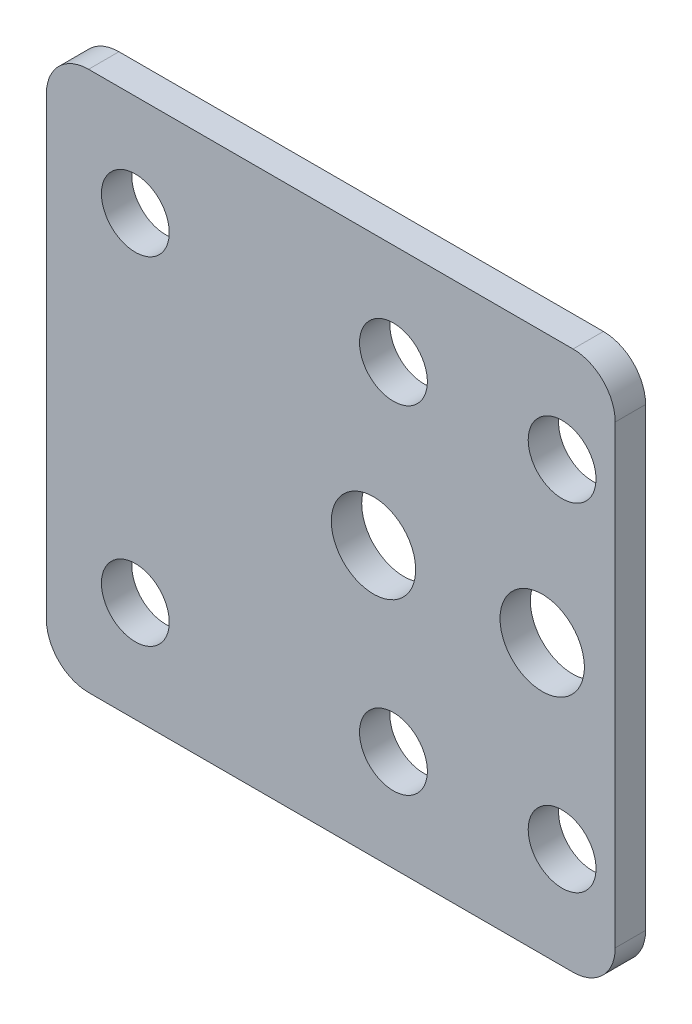
ISO-10303-21;
HEADER;
FILE_DESCRIPTION(('STEP AP214'),'2;1');
FILE_NAME('part.step','',(''),(''),'','','');
FILE_SCHEMA(('AUTOMOTIVE_DESIGN { 1 0 10303 214 1 1 1 1 }'));
ENDSEC;
DATA;
#1=APPLICATION_CONTEXT('core data for automotive mechanical design processes');
#2=APPLICATION_PROTOCOL_DEFINITION('international standard','automotive_design',2000,#1);
#3=PRODUCT_CONTEXT('',#1,'mechanical');
#4=PRODUCT('Part','Part','',(#3));
#5=PRODUCT_RELATED_PRODUCT_CATEGORY('part','',(#4));
#6=PRODUCT_DEFINITION_FORMATION('','',#4);
#7=PRODUCT_DEFINITION_CONTEXT('part definition',#1,'design');
#8=PRODUCT_DEFINITION('design','',#6,#7);
#9=PRODUCT_DEFINITION_SHAPE('','',#8);
#10=(LENGTH_UNIT() NAMED_UNIT(*) SI_UNIT(.MILLI.,.METRE.));
#11=(NAMED_UNIT(*) PLANE_ANGLE_UNIT() SI_UNIT($,.RADIAN.));
#12=(NAMED_UNIT(*) SI_UNIT($,.STERADIAN.) SOLID_ANGLE_UNIT());
#13=UNCERTAINTY_MEASURE_WITH_UNIT(LENGTH_MEASURE(1.E-05),#10,'distance_accuracy_value','');
#14=(GEOMETRIC_REPRESENTATION_CONTEXT(3) GLOBAL_UNCERTAINTY_ASSIGNED_CONTEXT((#13)) GLOBAL_UNIT_ASSIGNED_CONTEXT((#10,
#11,#12)) REPRESENTATION_CONTEXT('',''));
#15=CARTESIAN_POINT('',(0.,0.,0.));
#16=DIRECTION('',(0.,0.,1.));
#17=DIRECTION('',(1.,0.,0.));
#18=AXIS2_PLACEMENT_3D('',#15,#16,#17);
#19=CARTESIAN_POINT('',(-157.318460543692,-191.501541921578,2.286));
#20=DIRECTION('',(1.,0.,0.));
#21=DIRECTION('',(0.,0.,-1.));
#22=AXIS2_PLACEMENT_3D('',#19,#20,#21);
#23=PLANE('',#22);
#24=DIRECTION('',(0.,-1.,0.));
#25=VECTOR('',#24,1.);
#26=CARTESIAN_POINT('',(-157.318460543692,-191.501541921578,2.286));
#27=LINE('',#26,#25);
#28=CARTESIAN_POINT('',(-157.318460543692,-154.036541921578,2.286));
#29=VERTEX_POINT('',#28);
#30=CARTESIAN_POINT('',(-157.318460543692,-188.326541921578,2.286));
#31=VERTEX_POINT('',#30);
#32=EDGE_CURVE('E124',#29,#31,#27,.T.);
#33=ORIENTED_EDGE('',*,*,#32,.F.);
#34=DIRECTION('',(0.,0.,-1.));
#35=VECTOR('',#34,1.);
#36=CARTESIAN_POINT('',(-157.318460543692,-154.036541921578,2.286));
#37=LINE('',#36,#35);
#38=CARTESIAN_POINT('',(-157.318460543692,-154.036541921578,0.));
#39=VERTEX_POINT('',#38);
#40=EDGE_CURVE('E110',#29,#39,#37,.T.);
#41=ORIENTED_EDGE('',*,*,#40,.T.);
#42=DIRECTION('',(0.,-1.,0.));
#43=VECTOR('',#42,1.);
#44=CARTESIAN_POINT('',(-157.318460543692,-191.501541921578,0.));
#45=LINE('',#44,#43);
#46=CARTESIAN_POINT('',(-157.318460543692,-188.326541921578,0.));
#47=VERTEX_POINT('',#46);
#48=EDGE_CURVE('E121',#39,#47,#45,.T.);
#49=ORIENTED_EDGE('',*,*,#48,.T.);
#50=DIRECTION('',(0.,0.,-1.));
#51=VECTOR('',#50,1.);
#52=CARTESIAN_POINT('',(-157.318460543692,-188.326541921578,2.286));
#53=LINE('',#52,#51);
#54=EDGE_CURVE('E125',#47,#31,#53,.F.);
#55=ORIENTED_EDGE('',*,*,#54,.T.);
#56=EDGE_LOOP('',(#33,#41,#49,#55));
#57=FACE_BOUND('',#56,.T.);
#58=ADVANCED_FACE('F38',(#57),#23,.F.);
#59=CARTESIAN_POINT('',(-157.318460543692,-191.501541921578,2.286));
#60=DIRECTION('',(0.,1.,0.));
#61=DIRECTION('',(-1.,0.,0.));
#62=AXIS2_PLACEMENT_3D('',#59,#60,#61);
#63=PLANE('',#62);
#64=DIRECTION('',(1.,0.,0.));
#65=VECTOR('',#64,1.);
#66=CARTESIAN_POINT('',(-157.318460543692,-191.501541921578,0.));
#67=LINE('',#66,#65);
#68=CARTESIAN_POINT('',(-154.143460543692,-191.501541921578,0.));
#69=VERTEX_POINT('',#68);
#70=CARTESIAN_POINT('',(-117.667699999999,-191.501541921578,0.));
#71=VERTEX_POINT('',#70);
#72=EDGE_CURVE('E130',#69,#71,#67,.T.);
#73=ORIENTED_EDGE('',*,*,#72,.T.);
#74=DIRECTION('',(0.,0.,1.));
#75=VECTOR('',#74,1.);
#76=CARTESIAN_POINT('',(-117.667699999999,-191.501541921578,2.286));
#77=LINE('',#76,#75);
#78=CARTESIAN_POINT('',(-117.667699999999,-191.501541921578,2.286));
#79=VERTEX_POINT('',#78);
#80=EDGE_CURVE('E154',#71,#79,#77,.T.);
#81=ORIENTED_EDGE('',*,*,#80,.T.);
#82=DIRECTION('',(1.,0.,0.));
#83=VECTOR('',#82,1.);
#84=CARTESIAN_POINT('',(-157.318460543692,-191.501541921578,2.286));
#85=LINE('',#84,#83);
#86=CARTESIAN_POINT('',(-154.143460543692,-191.501541921578,2.286));
#87=VERTEX_POINT('',#86);
#88=EDGE_CURVE('E179',#87,#79,#85,.T.);
#89=ORIENTED_EDGE('',*,*,#88,.F.);
#90=DIRECTION('',(0.,0.,-1.));
#91=VECTOR('',#90,1.);
#92=CARTESIAN_POINT('',(-154.143460543692,-191.501541921578,2.286));
#93=LINE('',#92,#91);
#94=EDGE_CURVE('E151',#87,#69,#93,.T.);
#95=ORIENTED_EDGE('',*,*,#94,.T.);
#96=EDGE_LOOP('',(#73,#81,#89,#95));
#97=FACE_BOUND('',#96,.T.);
#98=ADVANCED_FACE('F169',(#97),#63,.F.);
#99=CARTESIAN_POINT('',(-157.318460543692,-150.861541921578,2.286));
#100=DIRECTION('',(0.,-1.,0.));
#101=DIRECTION('',(0.,0.,-1.));
#102=AXIS2_PLACEMENT_3D('',#99,#100,#101);
#103=PLANE('',#102);
#104=DIRECTION('',(-1.,0.,0.));
#105=VECTOR('',#104,1.);
#106=CARTESIAN_POINT('',(-157.318460543692,-150.861541921578,2.286));
#107=LINE('',#106,#105);
#108=CARTESIAN_POINT('',(-117.667699999999,-150.861541921578,2.286));
#109=VERTEX_POINT('',#108);
#110=CARTESIAN_POINT('',(-154.143460543692,-150.861541921578,2.286));
#111=VERTEX_POINT('',#110);
#112=EDGE_CURVE('E140',#109,#111,#107,.T.);
#113=ORIENTED_EDGE('',*,*,#112,.F.);
#114=DIRECTION('',(0.,0.,-1.));
#115=VECTOR('',#114,1.);
#116=CARTESIAN_POINT('',(-117.667699999999,-150.861541921578,2.286));
#117=LINE('',#116,#115);
#118=CARTESIAN_POINT('',(-117.667699999999,-150.861541921578,0.));
#119=VERTEX_POINT('',#118);
#120=EDGE_CURVE('E11',#109,#119,#117,.T.);
#121=ORIENTED_EDGE('',*,*,#120,.T.);
#122=DIRECTION('',(-1.,0.,0.));
#123=VECTOR('',#122,1.);
#124=CARTESIAN_POINT('',(-157.318460543692,-150.861541921578,0.));
#125=LINE('',#124,#123);
#126=CARTESIAN_POINT('',(-154.143460543692,-150.861541921578,0.));
#127=VERTEX_POINT('',#126);
#128=EDGE_CURVE('E134',#119,#127,#125,.T.);
#129=ORIENTED_EDGE('',*,*,#128,.T.);
#130=DIRECTION('',(0.,0.,-1.));
#131=VECTOR('',#130,1.);
#132=CARTESIAN_POINT('',(-154.143460543692,-150.861541921578,2.286));
#133=LINE('',#132,#131);
#134=EDGE_CURVE('E112',#127,#111,#133,.F.);
#135=ORIENTED_EDGE('',*,*,#134,.T.);
#136=EDGE_LOOP('',(#113,#121,#129,#135));
#137=FACE_BOUND('',#136,.T.);
#138=ADVANCED_FACE('F230',(#137),#103,.F.);
#139=CARTESIAN_POINT('',(0.,0.,2.286));
#140=DIRECTION('',(0.,0.,-1.));
#141=DIRECTION('',(-1.,0.,0.));
#142=AXIS2_PLACEMENT_3D('',#139,#140,#141);
#143=PLANE('',#142);
#144=CARTESIAN_POINT('',(-131.191799999999,-183.881541921578,2.286));
#145=DIRECTION('',(0.,0.,-1.));
#146=DIRECTION('',(-1.,0.,0.));
#147=AXIS2_PLACEMENT_3D('',#144,#145,#146);
#148=CIRCLE('',#147,2.55270000000001);
#149=CARTESIAN_POINT('',(-133.744499999999,-183.881541921578,2.286));
#150=VERTEX_POINT('',#149);
#151=EDGE_CURVE('E187',#150,#150,#148,.F.);
#152=ORIENTED_EDGE('',*,*,#151,.F.);
#153=EDGE_LOOP('',(#152));
#154=FACE_BOUND('',#153,.T.);
#155=CARTESIAN_POINT('',(-132.691799999999,-171.181541921578,2.286));
#156=DIRECTION('',(0.,0.,-1.));
#157=DIRECTION('',(-1.,0.,0.));
#158=AXIS2_PLACEMENT_3D('',#155,#156,#157);
#159=CIRCLE('',#158,3.175);
#160=CARTESIAN_POINT('',(-135.866799999999,-171.181541921578,2.286));
#161=VERTEX_POINT('',#160);
#162=EDGE_CURVE('E193',#161,#161,#159,.F.);
#163=ORIENTED_EDGE('',*,*,#162,.F.);
#164=EDGE_LOOP('',(#163));
#165=FACE_BOUND('',#164,.T.);
#166=CARTESIAN_POINT('',(-131.191799999999,-158.481541921578,2.286));
#167=DIRECTION('',(0.,0.,-1.));
#168=DIRECTION('',(-1.,0.,0.));
#169=AXIS2_PLACEMENT_3D('',#166,#167,#168);
#170=CIRCLE('',#169,2.55270000000001);
#171=CARTESIAN_POINT('',(-133.744499999999,-158.481541921578,2.286));
#172=VERTEX_POINT('',#171);
#173=EDGE_CURVE('E199',#172,#172,#170,.F.);
#174=ORIENTED_EDGE('',*,*,#173,.F.);
#175=EDGE_LOOP('',(#174));
#176=FACE_BOUND('',#175,.T.);
#177=CARTESIAN_POINT('',(-118.491799999999,-183.881541921578,2.286));
#178=DIRECTION('',(0.,0.,-1.));
#179=DIRECTION('',(-1.,0.,0.));
#180=AXIS2_PLACEMENT_3D('',#177,#178,#179);
#181=CIRCLE('',#180,2.55270000000001);
#182=CARTESIAN_POINT('',(-121.044499999999,-183.881541921578,2.286));
#183=VERTEX_POINT('',#182);
#184=EDGE_CURVE('E205',#183,#183,#181,.F.);
#185=ORIENTED_EDGE('',*,*,#184,.F.);
#186=EDGE_LOOP('',(#185));
#187=FACE_BOUND('',#186,.T.);
#188=CARTESIAN_POINT('',(-119.991799999999,-171.181541921578,2.286));
#189=DIRECTION('',(0.,0.,-1.));
#190=DIRECTION('',(-1.,0.,0.));
#191=AXIS2_PLACEMENT_3D('',#188,#189,#190);
#192=CIRCLE('',#191,3.175);
#193=CARTESIAN_POINT('',(-123.166799999999,-171.181541921578,2.286));
#194=VERTEX_POINT('',#193);
#195=EDGE_CURVE('E211',#194,#194,#192,.F.);
#196=ORIENTED_EDGE('',*,*,#195,.F.);
#197=EDGE_LOOP('',(#196));
#198=FACE_BOUND('',#197,.T.);
#199=CARTESIAN_POINT('',(-118.491799999999,-158.481541921578,2.286));
#200=DIRECTION('',(0.,0.,-1.));
#201=DIRECTION('',(-1.,0.,0.));
#202=AXIS2_PLACEMENT_3D('',#199,#200,#201);
#203=CIRCLE('',#202,2.55270000000001);
#204=CARTESIAN_POINT('',(-121.044499999999,-158.481541921578,2.286));
#205=VERTEX_POINT('',#204);
#206=EDGE_CURVE('E217',#205,#205,#203,.F.);
#207=ORIENTED_EDGE('',*,*,#206,.F.);
#208=EDGE_LOOP('',(#207));
#209=FACE_BOUND('',#208,.T.);
#210=CARTESIAN_POINT('',(-150.623199999999,-183.881541921578,2.286));
#211=DIRECTION('',(0.,0.,-1.));
#212=DIRECTION('',(-1.,0.,0.));
#213=AXIS2_PLACEMENT_3D('',#210,#211,#212);
#214=CIRCLE('',#213,2.55270000000001);
#215=CARTESIAN_POINT('',(-153.175899999999,-183.881541921578,2.286));
#216=VERTEX_POINT('',#215);
#217=EDGE_CURVE('E223',#216,#216,#214,.F.);
#218=ORIENTED_EDGE('',*,*,#217,.F.);
#219=EDGE_LOOP('',(#218));
#220=FACE_BOUND('',#219,.T.);
#221=CARTESIAN_POINT('',(-150.623199999999,-158.481541921578,2.286));
#222=DIRECTION('',(0.,0.,-1.));
#223=DIRECTION('',(-1.,0.,0.));
#224=AXIS2_PLACEMENT_3D('',#221,#222,#223);
#225=CIRCLE('',#224,2.55269999999999);
#226=CARTESIAN_POINT('',(-153.175899999999,-158.481541921578,2.286));
#227=VERTEX_POINT('',#226);
#228=EDGE_CURVE('E131',#227,#227,#225,.F.);
#229=ORIENTED_EDGE('',*,*,#228,.F.);
#230=EDGE_LOOP('',(#229));
#231=FACE_BOUND('',#230,.T.);
#232=ORIENTED_EDGE('',*,*,#88,.T.);
#233=CARTESIAN_POINT('',(-117.667699999999,-188.326541921578,2.286));
#234=DIRECTION('',(0.,0.,-1.));
#235=DIRECTION('',(-1.,0.,0.));
#236=AXIS2_PLACEMENT_3D('',#233,#234,#235);
#237=CIRCLE('',#236,3.175);
#238=CARTESIAN_POINT('',(-114.492699999999,-188.326541921578,2.286));
#239=VERTEX_POINT('',#238);
#240=EDGE_CURVE('E159',#79,#239,#237,.F.);
#241=ORIENTED_EDGE('',*,*,#240,.T.);
#242=DIRECTION('',(0.,-1.,0.));
#243=VECTOR('',#242,1.);
#244=CARTESIAN_POINT('',(-114.492699999999,-202.564565206785,2.286));
#245=LINE('',#244,#243);
#246=CARTESIAN_POINT('',(-114.492699999999,-154.036541921578,2.286));
#247=VERTEX_POINT('',#246);
#248=EDGE_CURVE('E177',#247,#239,#245,.T.);
#249=ORIENTED_EDGE('',*,*,#248,.F.);
#250=CARTESIAN_POINT('',(-117.667699999999,-154.036541921578,2.286));
#251=DIRECTION('',(0.,0.,-1.));
#252=DIRECTION('',(-1.,0.,0.));
#253=AXIS2_PLACEMENT_3D('',#250,#251,#252);
#254=CIRCLE('',#253,3.175);
#255=EDGE_CURVE('E157',#247,#109,#254,.F.);
#256=ORIENTED_EDGE('',*,*,#255,.T.);
#257=ORIENTED_EDGE('',*,*,#112,.T.);
#258=CARTESIAN_POINT('',(-154.143460543692,-154.036541921578,2.286));
#259=DIRECTION('',(0.,0.,-1.));
#260=DIRECTION('',(-1.,0.,0.));
#261=AXIS2_PLACEMENT_3D('',#258,#259,#260);
#262=CIRCLE('',#261,3.175);
#263=EDGE_CURVE('E149',#111,#29,#262,.F.);
#264=ORIENTED_EDGE('',*,*,#263,.T.);
#265=ORIENTED_EDGE('',*,*,#32,.T.);
#266=CARTESIAN_POINT('',(-154.143460543692,-188.326541921578,2.286));
#267=DIRECTION('',(0.,0.,-1.));
#268=DIRECTION('',(-1.,0.,0.));
#269=AXIS2_PLACEMENT_3D('',#266,#267,#268);
#270=CIRCLE('',#269,3.175);
#271=EDGE_CURVE('E147',#31,#87,#270,.F.);
#272=ORIENTED_EDGE('',*,*,#271,.T.);
#273=EDGE_LOOP('',(#232,#241,#249,#256,#257,#264,#265,#272));
#274=FACE_BOUND('',#273,.T.);
#275=ADVANCED_FACE('F176',(#154,#165,#176,#187,#198,#209,#220,#231,#274),#143,.F.);
#276=CARTESIAN_POINT('',(0.,0.,0.));
#277=DIRECTION('',(0.,0.,-1.));
#278=DIRECTION('',(-1.,0.,0.));
#279=AXIS2_PLACEMENT_3D('',#276,#277,#278);
#280=PLANE('',#279);
#281=DIRECTION('',(0.,-1.,0.));
#282=VECTOR('',#281,1.);
#283=CARTESIAN_POINT('',(-114.492699999999,-202.564565206785,0.));
#284=LINE('',#283,#282);
#285=CARTESIAN_POINT('',(-114.492699999999,-154.036541921578,0.));
#286=VERTEX_POINT('',#285);
#287=CARTESIAN_POINT('',(-114.492699999999,-188.326541921578,0.));
#288=VERTEX_POINT('',#287);
#289=EDGE_CURVE('E165',#286,#288,#284,.T.);
#290=ORIENTED_EDGE('',*,*,#289,.T.);
#291=CARTESIAN_POINT('',(-117.667699999999,-188.326541921578,0.));
#292=DIRECTION('',(0.,0.,-1.));
#293=DIRECTION('',(-1.,0.,0.));
#294=AXIS2_PLACEMENT_3D('',#291,#292,#293);
#295=CIRCLE('',#294,3.175);
#296=EDGE_CURVE('E46',#288,#71,#295,.T.);
#297=ORIENTED_EDGE('',*,*,#296,.T.);
#298=ORIENTED_EDGE('',*,*,#72,.F.);
#299=CARTESIAN_POINT('',(-154.143460543692,-188.326541921578,0.));
#300=DIRECTION('',(0.,0.,-1.));
#301=DIRECTION('',(-1.,0.,0.));
#302=AXIS2_PLACEMENT_3D('',#299,#300,#301);
#303=CIRCLE('',#302,3.175);
#304=EDGE_CURVE('E116',#69,#47,#303,.T.);
#305=ORIENTED_EDGE('',*,*,#304,.T.);
#306=ORIENTED_EDGE('',*,*,#48,.F.);
#307=CARTESIAN_POINT('',(-154.143460543692,-154.036541921578,0.));
#308=DIRECTION('',(0.,0.,-1.));
#309=DIRECTION('',(-1.,0.,0.));
#310=AXIS2_PLACEMENT_3D('',#307,#308,#309);
#311=CIRCLE('',#310,3.175);
#312=EDGE_CURVE('E106',#39,#127,#311,.T.);
#313=ORIENTED_EDGE('',*,*,#312,.T.);
#314=ORIENTED_EDGE('',*,*,#128,.F.);
#315=CARTESIAN_POINT('',(-117.667699999999,-154.036541921578,0.));
#316=DIRECTION('',(0.,0.,-1.));
#317=DIRECTION('',(-1.,0.,0.));
#318=AXIS2_PLACEMENT_3D('',#315,#316,#317);
#319=CIRCLE('',#318,3.175);
#320=EDGE_CURVE('E53',#119,#286,#319,.T.);
#321=ORIENTED_EDGE('',*,*,#320,.T.);
#322=EDGE_LOOP('',(#290,#297,#298,#305,#306,#313,#314,#321));
#323=FACE_BOUND('',#322,.T.);
#324=CARTESIAN_POINT('',(-131.191799999999,-183.881541921578,0.));
#325=DIRECTION('',(0.,0.,-1.));
#326=DIRECTION('',(-1.,0.,0.));
#327=AXIS2_PLACEMENT_3D('',#324,#325,#326);
#328=CIRCLE('',#327,2.55270000000001);
#329=CARTESIAN_POINT('',(-133.744499999999,-183.881541921578,0.));
#330=VERTEX_POINT('',#329);
#331=EDGE_CURVE('E182',#330,#330,#328,.T.);
#332=ORIENTED_EDGE('',*,*,#331,.F.);
#333=EDGE_LOOP('',(#332));
#334=FACE_BOUND('',#333,.T.);
#335=CARTESIAN_POINT('',(-132.691799999999,-171.181541921578,0.));
#336=DIRECTION('',(0.,0.,-1.));
#337=DIRECTION('',(-1.,0.,0.));
#338=AXIS2_PLACEMENT_3D('',#335,#336,#337);
#339=CIRCLE('',#338,3.175);
#340=CARTESIAN_POINT('',(-135.866799999999,-171.181541921578,0.));
#341=VERTEX_POINT('',#340);
#342=EDGE_CURVE('E190',#341,#341,#339,.T.);
#343=ORIENTED_EDGE('',*,*,#342,.F.);
#344=EDGE_LOOP('',(#343));
#345=FACE_BOUND('',#344,.T.);
#346=CARTESIAN_POINT('',(-131.191799999999,-158.481541921578,0.));
#347=DIRECTION('',(0.,0.,-1.));
#348=DIRECTION('',(-1.,0.,0.));
#349=AXIS2_PLACEMENT_3D('',#346,#347,#348);
#350=CIRCLE('',#349,2.55270000000001);
#351=CARTESIAN_POINT('',(-133.744499999999,-158.481541921578,0.));
#352=VERTEX_POINT('',#351);
#353=EDGE_CURVE('E196',#352,#352,#350,.T.);
#354=ORIENTED_EDGE('',*,*,#353,.F.);
#355=EDGE_LOOP('',(#354));
#356=FACE_BOUND('',#355,.T.);
#357=CARTESIAN_POINT('',(-118.491799999999,-183.881541921578,0.));
#358=DIRECTION('',(0.,0.,-1.));
#359=DIRECTION('',(-1.,0.,0.));
#360=AXIS2_PLACEMENT_3D('',#357,#358,#359);
#361=CIRCLE('',#360,2.55270000000001);
#362=CARTESIAN_POINT('',(-121.044499999999,-183.881541921578,0.));
#363=VERTEX_POINT('',#362);
#364=EDGE_CURVE('E202',#363,#363,#361,.T.);
#365=ORIENTED_EDGE('',*,*,#364,.F.);
#366=EDGE_LOOP('',(#365));
#367=FACE_BOUND('',#366,.T.);
#368=CARTESIAN_POINT('',(-119.991799999999,-171.181541921578,0.));
#369=DIRECTION('',(0.,0.,-1.));
#370=DIRECTION('',(-1.,0.,0.));
#371=AXIS2_PLACEMENT_3D('',#368,#369,#370);
#372=CIRCLE('',#371,3.175);
#373=CARTESIAN_POINT('',(-123.166799999999,-171.181541921578,0.));
#374=VERTEX_POINT('',#373);
#375=EDGE_CURVE('E208',#374,#374,#372,.T.);
#376=ORIENTED_EDGE('',*,*,#375,.F.);
#377=EDGE_LOOP('',(#376));
#378=FACE_BOUND('',#377,.T.);
#379=CARTESIAN_POINT('',(-118.491799999999,-158.481541921578,0.));
#380=DIRECTION('',(0.,0.,-1.));
#381=DIRECTION('',(-1.,0.,0.));
#382=AXIS2_PLACEMENT_3D('',#379,#380,#381);
#383=CIRCLE('',#382,2.55270000000001);
#384=CARTESIAN_POINT('',(-121.044499999999,-158.481541921578,0.));
#385=VERTEX_POINT('',#384);
#386=EDGE_CURVE('E214',#385,#385,#383,.T.);
#387=ORIENTED_EDGE('',*,*,#386,.F.);
#388=EDGE_LOOP('',(#387));
#389=FACE_BOUND('',#388,.T.);
#390=CARTESIAN_POINT('',(-150.623199999999,-183.881541921578,0.));
#391=DIRECTION('',(0.,0.,-1.));
#392=DIRECTION('',(-1.,0.,0.));
#393=AXIS2_PLACEMENT_3D('',#390,#391,#392);
#394=CIRCLE('',#393,2.55270000000001);
#395=CARTESIAN_POINT('',(-153.175899999999,-183.881541921578,0.));
#396=VERTEX_POINT('',#395);
#397=EDGE_CURVE('E220',#396,#396,#394,.T.);
#398=ORIENTED_EDGE('',*,*,#397,.F.);
#399=EDGE_LOOP('',(#398));
#400=FACE_BOUND('',#399,.T.);
#401=CARTESIAN_POINT('',(-150.623199999999,-158.481541921578,0.));
#402=DIRECTION('',(0.,0.,-1.));
#403=DIRECTION('',(-1.,0.,0.));
#404=AXIS2_PLACEMENT_3D('',#401,#402,#403);
#405=CIRCLE('',#404,2.55269999999999);
#406=CARTESIAN_POINT('',(-153.175899999999,-158.481541921578,0.));
#407=VERTEX_POINT('',#406);
#408=EDGE_CURVE('E137',#407,#407,#405,.T.);
#409=ORIENTED_EDGE('',*,*,#408,.F.);
#410=EDGE_LOOP('',(#409));
#411=FACE_BOUND('',#410,.T.);
#412=ADVANCED_FACE('F127',(#323,#334,#345,#356,#367,#378,#389,#400,#411),#280,.T.);
#413=CARTESIAN_POINT('',(-150.623199999999,-158.481541921578,2.287));
#414=DIRECTION('',(0.,0.,-1.));
#415=DIRECTION('',(-1.,0.,0.));
#416=AXIS2_PLACEMENT_3D('',#413,#414,#415);
#417=CYLINDRICAL_SURFACE('',#416,2.55269999999999);
#418=ORIENTED_EDGE('',*,*,#408,.T.);
#419=EDGE_LOOP('',(#418));
#420=FACE_BOUND('',#419,.T.);
#421=ORIENTED_EDGE('',*,*,#228,.T.);
#422=EDGE_LOOP('',(#421));
#423=FACE_BOUND('',#422,.T.);
#424=ADVANCED_FACE('F283',(#420,#423),#417,.F.);
#425=CARTESIAN_POINT('',(-150.623199999999,-183.881541921578,2.287));
#426=DIRECTION('',(0.,0.,-1.));
#427=DIRECTION('',(-1.,0.,0.));
#428=AXIS2_PLACEMENT_3D('',#425,#426,#427);
#429=CYLINDRICAL_SURFACE('',#428,2.55270000000001);
#430=ORIENTED_EDGE('',*,*,#397,.T.);
#431=EDGE_LOOP('',(#430));
#432=FACE_BOUND('',#431,.T.);
#433=ORIENTED_EDGE('',*,*,#217,.T.);
#434=EDGE_LOOP('',(#433));
#435=FACE_BOUND('',#434,.T.);
#436=ADVANCED_FACE('F279',(#432,#435),#429,.F.);
#437=CARTESIAN_POINT('',(-118.491799999999,-158.481541921578,2.287));
#438=DIRECTION('',(0.,0.,-1.));
#439=DIRECTION('',(-1.,0.,0.));
#440=AXIS2_PLACEMENT_3D('',#437,#438,#439);
#441=CYLINDRICAL_SURFACE('',#440,2.55270000000001);
#442=ORIENTED_EDGE('',*,*,#386,.T.);
#443=EDGE_LOOP('',(#442));
#444=FACE_BOUND('',#443,.T.);
#445=ORIENTED_EDGE('',*,*,#206,.T.);
#446=EDGE_LOOP('',(#445));
#447=FACE_BOUND('',#446,.T.);
#448=ADVANCED_FACE('F275',(#444,#447),#441,.F.);
#449=CARTESIAN_POINT('',(-119.991799999999,-171.181541921578,2.287));
#450=DIRECTION('',(0.,0.,-1.));
#451=DIRECTION('',(-1.,0.,0.));
#452=AXIS2_PLACEMENT_3D('',#449,#450,#451);
#453=CYLINDRICAL_SURFACE('',#452,3.175);
#454=ORIENTED_EDGE('',*,*,#375,.T.);
#455=EDGE_LOOP('',(#454));
#456=FACE_BOUND('',#455,.T.);
#457=ORIENTED_EDGE('',*,*,#195,.T.);
#458=EDGE_LOOP('',(#457));
#459=FACE_BOUND('',#458,.T.);
#460=ADVANCED_FACE('F271',(#456,#459),#453,.F.);
#461=CARTESIAN_POINT('',(-118.491799999999,-183.881541921578,2.287));
#462=DIRECTION('',(0.,0.,-1.));
#463=DIRECTION('',(-1.,0.,0.));
#464=AXIS2_PLACEMENT_3D('',#461,#462,#463);
#465=CYLINDRICAL_SURFACE('',#464,2.55270000000001);
#466=ORIENTED_EDGE('',*,*,#364,.T.);
#467=EDGE_LOOP('',(#466));
#468=FACE_BOUND('',#467,.T.);
#469=ORIENTED_EDGE('',*,*,#184,.T.);
#470=EDGE_LOOP('',(#469));
#471=FACE_BOUND('',#470,.T.);
#472=ADVANCED_FACE('F267',(#468,#471),#465,.F.);
#473=CARTESIAN_POINT('',(-131.191799999999,-158.481541921578,2.287));
#474=DIRECTION('',(0.,0.,-1.));
#475=DIRECTION('',(-1.,0.,0.));
#476=AXIS2_PLACEMENT_3D('',#473,#474,#475);
#477=CYLINDRICAL_SURFACE('',#476,2.55270000000001);
#478=ORIENTED_EDGE('',*,*,#353,.T.);
#479=EDGE_LOOP('',(#478));
#480=FACE_BOUND('',#479,.T.);
#481=ORIENTED_EDGE('',*,*,#173,.T.);
#482=EDGE_LOOP('',(#481));
#483=FACE_BOUND('',#482,.T.);
#484=ADVANCED_FACE('F263',(#480,#483),#477,.F.);
#485=CARTESIAN_POINT('',(-132.691799999999,-171.181541921578,2.287));
#486=DIRECTION('',(0.,0.,-1.));
#487=DIRECTION('',(-1.,0.,0.));
#488=AXIS2_PLACEMENT_3D('',#485,#486,#487);
#489=CYLINDRICAL_SURFACE('',#488,3.175);
#490=ORIENTED_EDGE('',*,*,#342,.T.);
#491=EDGE_LOOP('',(#490));
#492=FACE_BOUND('',#491,.T.);
#493=ORIENTED_EDGE('',*,*,#162,.T.);
#494=EDGE_LOOP('',(#493));
#495=FACE_BOUND('',#494,.T.);
#496=ADVANCED_FACE('F259',(#492,#495),#489,.F.);
#497=CARTESIAN_POINT('',(-131.191799999999,-183.881541921578,2.287));
#498=DIRECTION('',(0.,0.,-1.));
#499=DIRECTION('',(-1.,0.,0.));
#500=AXIS2_PLACEMENT_3D('',#497,#498,#499);
#501=CYLINDRICAL_SURFACE('',#500,2.55270000000001);
#502=ORIENTED_EDGE('',*,*,#331,.T.);
#503=EDGE_LOOP('',(#502));
#504=FACE_BOUND('',#503,.T.);
#505=ORIENTED_EDGE('',*,*,#151,.T.);
#506=EDGE_LOOP('',(#505));
#507=FACE_BOUND('',#506,.T.);
#508=ADVANCED_FACE('F246',(#504,#507),#501,.F.);
#509=CARTESIAN_POINT('',(-154.143460543692,-154.036541921578,2.286));
#510=DIRECTION('',(0.,0.,-1.));
#511=DIRECTION('',(-1.,0.,0.));
#512=AXIS2_PLACEMENT_3D('',#509,#510,#511);
#513=CYLINDRICAL_SURFACE('',#512,3.175);
#514=ORIENTED_EDGE('',*,*,#263,.F.);
#515=ORIENTED_EDGE('',*,*,#134,.F.);
#516=ORIENTED_EDGE('',*,*,#312,.F.);
#517=ORIENTED_EDGE('',*,*,#40,.F.);
#518=EDGE_LOOP('',(#514,#515,#516,#517));
#519=FACE_BOUND('',#518,.T.);
#520=ADVANCED_FACE('F109',(#519),#513,.T.);
#521=CARTESIAN_POINT('',(-154.143460543692,-188.326541921578,2.286));
#522=DIRECTION('',(0.,0.,-1.));
#523=DIRECTION('',(-1.,0.,0.));
#524=AXIS2_PLACEMENT_3D('',#521,#522,#523);
#525=CYLINDRICAL_SURFACE('',#524,3.175);
#526=ORIENTED_EDGE('',*,*,#271,.F.);
#527=ORIENTED_EDGE('',*,*,#54,.F.);
#528=ORIENTED_EDGE('',*,*,#304,.F.);
#529=ORIENTED_EDGE('',*,*,#94,.F.);
#530=EDGE_LOOP('',(#526,#527,#528,#529));
#531=FACE_BOUND('',#530,.T.);
#532=ADVANCED_FACE('F245',(#531),#525,.T.);
#533=CARTESIAN_POINT('',(-114.492699999999,-202.564565206785,0.));
#534=DIRECTION('',(-1.,0.,0.));
#535=DIRECTION('',(0.,0.,1.));
#536=AXIS2_PLACEMENT_3D('',#533,#534,#535);
#537=PLANE('',#536);
#538=ORIENTED_EDGE('',*,*,#248,.T.);
#539=DIRECTION('',(0.,0.,1.));
#540=VECTOR('',#539,1.);
#541=CARTESIAN_POINT('',(-114.492699999999,-188.326541921578,0.));
#542=LINE('',#541,#540);
#543=EDGE_CURVE('E60',#239,#288,#542,.F.);
#544=ORIENTED_EDGE('',*,*,#543,.T.);
#545=ORIENTED_EDGE('',*,*,#289,.F.);
#546=DIRECTION('',(0.,0.,-1.));
#547=VECTOR('',#546,1.);
#548=CARTESIAN_POINT('',(-114.492699999999,-154.036541921578,0.));
#549=LINE('',#548,#547);
#550=EDGE_CURVE('E161',#286,#247,#549,.F.);
#551=ORIENTED_EDGE('',*,*,#550,.T.);
#552=EDGE_LOOP('',(#538,#544,#545,#551));
#553=FACE_BOUND('',#552,.T.);
#554=ADVANCED_FACE('F180',(#553),#537,.F.);
#555=CARTESIAN_POINT('',(-117.667699999999,-188.326541921578,2.286));
#556=DIRECTION('',(0.,0.,1.));
#557=DIRECTION('',(1.,0.,0.));
#558=AXIS2_PLACEMENT_3D('',#555,#556,#557);
#559=CYLINDRICAL_SURFACE('',#558,3.175);
#560=ORIENTED_EDGE('',*,*,#296,.F.);
#561=ORIENTED_EDGE('',*,*,#543,.F.);
#562=ORIENTED_EDGE('',*,*,#240,.F.);
#563=ORIENTED_EDGE('',*,*,#80,.F.);
#564=EDGE_LOOP('',(#560,#561,#562,#563));
#565=FACE_BOUND('',#564,.T.);
#566=ADVANCED_FACE('F173',(#565),#559,.T.);
#567=CARTESIAN_POINT('',(-117.667699999999,-154.036541921578,2.286));
#568=DIRECTION('',(0.,0.,-1.));
#569=DIRECTION('',(-1.,0.,0.));
#570=AXIS2_PLACEMENT_3D('',#567,#568,#569);
#571=CYLINDRICAL_SURFACE('',#570,3.175);
#572=ORIENTED_EDGE('',*,*,#255,.F.);
#573=ORIENTED_EDGE('',*,*,#550,.F.);
#574=ORIENTED_EDGE('',*,*,#320,.F.);
#575=ORIENTED_EDGE('',*,*,#120,.F.);
#576=EDGE_LOOP('',(#572,#573,#574,#575));
#577=FACE_BOUND('',#576,.T.);
#578=ADVANCED_FACE('F40',(#577),#571,.T.);
#579=CLOSED_SHELL('',(#58,#98,#138,#275,#412,#424,#436,#448,#460,#472,#484,#496,#508,#520,#532,
#554,#566,#578));
#580=MANIFOLD_SOLID_BREP('B2',#579);
#581=ADVANCED_BREP_SHAPE_REPRESENTATION('',(#18,#580),#14);
#582=SHAPE_DEFINITION_REPRESENTATION(#9,#581);
ENDSEC;
END-ISO-10303-21;
